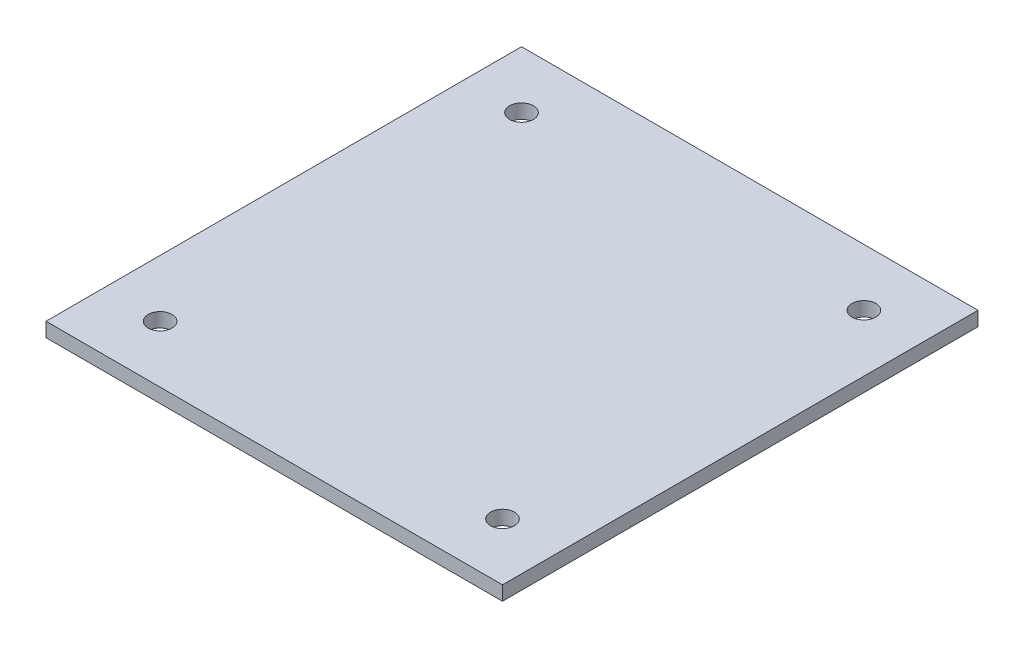
ISO-10303-21;
HEADER;
FILE_DESCRIPTION(('STEP AP214'),'2;1');
FILE_NAME('part.step','',(''),(''),'','','');
FILE_SCHEMA(('AUTOMOTIVE_DESIGN { 1 0 10303 214 1 1 1 1 }'));
ENDSEC;
DATA;
#1=APPLICATION_CONTEXT('core data for automotive mechanical design processes');
#2=APPLICATION_PROTOCOL_DEFINITION('international standard','automotive_design',2000,#1);
#3=PRODUCT_CONTEXT('',#1,'mechanical');
#4=PRODUCT('Part','Part','',(#3));
#5=PRODUCT_RELATED_PRODUCT_CATEGORY('part','',(#4));
#6=PRODUCT_DEFINITION_FORMATION('','',#4);
#7=PRODUCT_DEFINITION_CONTEXT('part definition',#1,'design');
#8=PRODUCT_DEFINITION('design','',#6,#7);
#9=PRODUCT_DEFINITION_SHAPE('','',#8);
#10=(LENGTH_UNIT() NAMED_UNIT(*) SI_UNIT(.MILLI.,.METRE.));
#11=(NAMED_UNIT(*) PLANE_ANGLE_UNIT() SI_UNIT($,.RADIAN.));
#12=(NAMED_UNIT(*) SI_UNIT($,.STERADIAN.) SOLID_ANGLE_UNIT());
#13=UNCERTAINTY_MEASURE_WITH_UNIT(LENGTH_MEASURE(1.E-05),#10,'distance_accuracy_value','');
#14=(GEOMETRIC_REPRESENTATION_CONTEXT(3) GLOBAL_UNCERTAINTY_ASSIGNED_CONTEXT((#13)) GLOBAL_UNIT_ASSIGNED_CONTEXT((#10,
#11,#12)) REPRESENTATION_CONTEXT('',''));
#15=CARTESIAN_POINT('',(0.,0.,0.));
#16=DIRECTION('',(0.,0.,1.));
#17=DIRECTION('',(1.,0.,0.));
#18=AXIS2_PLACEMENT_3D('',#15,#16,#17);
#19=CARTESIAN_POINT('',(-76.2,4.7625,-79.375));
#20=DIRECTION('',(1.,0.,0.));
#21=DIRECTION('',(0.,0.,-1.));
#22=AXIS2_PLACEMENT_3D('',#19,#20,#21);
#23=PLANE('',#22);
#24=DIRECTION('',(0.,0.,1.));
#25=VECTOR('',#24,1.);
#26=CARTESIAN_POINT('',(-76.2,0.,-79.375));
#27=LINE('',#26,#25);
#28=CARTESIAN_POINT('',(-76.2,0.,-79.375));
#29=VERTEX_POINT('',#28);
#30=CARTESIAN_POINT('',(-76.2,0.,79.375));
#31=VERTEX_POINT('',#30);
#32=EDGE_CURVE('E116',#29,#31,#27,.T.);
#33=ORIENTED_EDGE('',*,*,#32,.T.);
#34=DIRECTION('',(0.,-1.,0.));
#35=VECTOR('',#34,1.);
#36=CARTESIAN_POINT('',(-76.2,4.7625,79.375));
#37=LINE('',#36,#35);
#38=CARTESIAN_POINT('',(-76.2,4.7625,79.375));
#39=VERTEX_POINT('',#38);
#40=EDGE_CURVE('E11',#39,#31,#37,.T.);
#41=ORIENTED_EDGE('',*,*,#40,.F.);
#42=DIRECTION('',(0.,0.,1.));
#43=VECTOR('',#42,1.);
#44=CARTESIAN_POINT('',(-76.2,4.7625,-79.375));
#45=LINE('',#44,#43);
#46=CARTESIAN_POINT('',(-76.2,4.7625,-79.375));
#47=VERTEX_POINT('',#46);
#48=EDGE_CURVE('E99',#47,#39,#45,.T.);
#49=ORIENTED_EDGE('',*,*,#48,.F.);
#50=DIRECTION('',(0.,-1.,0.));
#51=VECTOR('',#50,1.);
#52=CARTESIAN_POINT('',(-76.2,4.7625,-79.375));
#53=LINE('',#52,#51);
#54=EDGE_CURVE('E112',#47,#29,#53,.T.);
#55=ORIENTED_EDGE('',*,*,#54,.T.);
#56=EDGE_LOOP('',(#33,#41,#49,#55));
#57=FACE_BOUND('',#56,.T.);
#58=ADVANCED_FACE('F39',(#57),#23,.F.);
#59=CARTESIAN_POINT('',(76.2,4.7625,79.375));
#60=DIRECTION('',(0.,0.,-1.));
#61=DIRECTION('',(-1.,0.,0.));
#62=AXIS2_PLACEMENT_3D('',#59,#60,#61);
#63=PLANE('',#62);
#64=DIRECTION('',(1.,0.,0.));
#65=VECTOR('',#64,1.);
#66=CARTESIAN_POINT('',(76.2,0.,79.375));
#67=LINE('',#66,#65);
#68=CARTESIAN_POINT('',(76.2,0.,79.375));
#69=VERTEX_POINT('',#68);
#70=EDGE_CURVE('E104',#31,#69,#67,.T.);
#71=ORIENTED_EDGE('',*,*,#70,.T.);
#72=DIRECTION('',(0.,-1.,0.));
#73=VECTOR('',#72,1.);
#74=CARTESIAN_POINT('',(76.2,4.7625,79.375));
#75=LINE('',#74,#73);
#76=CARTESIAN_POINT('',(76.2,4.7625,79.375));
#77=VERTEX_POINT('',#76);
#78=EDGE_CURVE('E48',#77,#69,#75,.T.);
#79=ORIENTED_EDGE('',*,*,#78,.F.);
#80=DIRECTION('',(1.,0.,0.));
#81=VECTOR('',#80,1.);
#82=CARTESIAN_POINT('',(76.2,4.7625,79.375));
#83=LINE('',#82,#81);
#84=EDGE_CURVE('E94',#39,#77,#83,.T.);
#85=ORIENTED_EDGE('',*,*,#84,.F.);
#86=ORIENTED_EDGE('',*,*,#40,.T.);
#87=EDGE_LOOP('',(#71,#79,#85,#86));
#88=FACE_BOUND('',#87,.T.);
#89=ADVANCED_FACE('F103',(#88),#63,.F.);
#90=CARTESIAN_POINT('',(76.2,4.7625,-79.375));
#91=DIRECTION('',(-1.,0.,0.));
#92=DIRECTION('',(0.,0.,1.));
#93=AXIS2_PLACEMENT_3D('',#90,#91,#92);
#94=PLANE('',#93);
#95=DIRECTION('',(0.,0.,-1.));
#96=VECTOR('',#95,1.);
#97=CARTESIAN_POINT('',(76.2,0.,-79.375));
#98=LINE('',#97,#96);
#99=CARTESIAN_POINT('',(76.2,0.,-79.375));
#100=VERTEX_POINT('',#99);
#101=EDGE_CURVE('E79',#69,#100,#98,.T.);
#102=ORIENTED_EDGE('',*,*,#101,.T.);
#103=DIRECTION('',(0.,-1.,0.));
#104=VECTOR('',#103,1.);
#105=CARTESIAN_POINT('',(76.2,4.7625,-79.375));
#106=LINE('',#105,#104);
#107=CARTESIAN_POINT('',(76.2,4.7625,-79.375));
#108=VERTEX_POINT('',#107);
#109=EDGE_CURVE('E106',#108,#100,#106,.T.);
#110=ORIENTED_EDGE('',*,*,#109,.F.);
#111=DIRECTION('',(0.,0.,-1.));
#112=VECTOR('',#111,1.);
#113=CARTESIAN_POINT('',(76.2,4.7625,-79.375));
#114=LINE('',#113,#112);
#115=EDGE_CURVE('E97',#77,#108,#114,.T.);
#116=ORIENTED_EDGE('',*,*,#115,.F.);
#117=ORIENTED_EDGE('',*,*,#78,.T.);
#118=EDGE_LOOP('',(#102,#110,#116,#117));
#119=FACE_BOUND('',#118,.T.);
#120=ADVANCED_FACE('F107',(#119),#94,.F.);
#121=CARTESIAN_POINT('',(76.2,4.7625,-79.375));
#122=DIRECTION('',(0.,0.,1.));
#123=DIRECTION('',(1.,0.,0.));
#124=AXIS2_PLACEMENT_3D('',#121,#122,#123);
#125=PLANE('',#124);
#126=DIRECTION('',(-1.,0.,0.));
#127=VECTOR('',#126,1.);
#128=CARTESIAN_POINT('',(76.2,0.,-79.375));
#129=LINE('',#128,#127);
#130=EDGE_CURVE('E87',#100,#29,#129,.T.);
#131=ORIENTED_EDGE('',*,*,#130,.T.);
#132=ORIENTED_EDGE('',*,*,#54,.F.);
#133=DIRECTION('',(-1.,0.,0.));
#134=VECTOR('',#133,1.);
#135=CARTESIAN_POINT('',(76.2,4.7625,-79.375));
#136=LINE('',#135,#134);
#137=EDGE_CURVE('E58',#108,#47,#136,.T.);
#138=ORIENTED_EDGE('',*,*,#137,.F.);
#139=ORIENTED_EDGE('',*,*,#109,.T.);
#140=EDGE_LOOP('',(#131,#132,#138,#139));
#141=FACE_BOUND('',#140,.T.);
#142=ADVANCED_FACE('F130',(#141),#125,.F.);
#143=CARTESIAN_POINT('',(-76.2,4.7625,79.375));
#144=DIRECTION('',(0.,-1.,0.));
#145=DIRECTION('',(0.,0.,-1.));
#146=AXIS2_PLACEMENT_3D('',#143,#144,#145);
#147=PLANE('',#146);
#148=CARTESIAN_POINT('',(57.15,4.7625,60.325));
#149=DIRECTION('',(0.,1.,0.));
#150=DIRECTION('',(0.,0.,1.));
#151=AXIS2_PLACEMENT_3D('',#148,#149,#150);
#152=CIRCLE('',#151,3.96874999999999);
#153=CARTESIAN_POINT('',(57.15,4.7625,64.29375));
#154=VERTEX_POINT('',#153);
#155=EDGE_CURVE('E161',#154,#154,#152,.T.);
#156=ORIENTED_EDGE('',*,*,#155,.F.);
#157=EDGE_LOOP('',(#156));
#158=FACE_BOUND('',#157,.T.);
#159=CARTESIAN_POINT('',(-57.15,4.7625,60.325));
#160=DIRECTION('',(0.,1.,0.));
#161=DIRECTION('',(0.,0.,1.));
#162=AXIS2_PLACEMENT_3D('',#159,#160,#161);
#163=CIRCLE('',#162,3.96874999999999);
#164=CARTESIAN_POINT('',(-57.15,4.7625,64.29375));
#165=VERTEX_POINT('',#164);
#166=EDGE_CURVE('E153',#165,#165,#163,.T.);
#167=ORIENTED_EDGE('',*,*,#166,.F.);
#168=EDGE_LOOP('',(#167));
#169=FACE_BOUND('',#168,.T.);
#170=CARTESIAN_POINT('',(57.15,4.7625,-60.325));
#171=DIRECTION('',(0.,1.,0.));
#172=DIRECTION('',(0.,0.,1.));
#173=AXIS2_PLACEMENT_3D('',#170,#171,#172);
#174=CIRCLE('',#173,3.96874999999999);
#175=CARTESIAN_POINT('',(57.15,4.7625,-56.35625));
#176=VERTEX_POINT('',#175);
#177=EDGE_CURVE('E145',#176,#176,#174,.T.);
#178=ORIENTED_EDGE('',*,*,#177,.F.);
#179=EDGE_LOOP('',(#178));
#180=FACE_BOUND('',#179,.T.);
#181=CARTESIAN_POINT('',(-57.15,4.7625,-60.325));
#182=DIRECTION('',(0.,1.,0.));
#183=DIRECTION('',(0.,0.,1.));
#184=AXIS2_PLACEMENT_3D('',#181,#182,#183);
#185=CIRCLE('',#184,3.96874999999999);
#186=CARTESIAN_POINT('',(-57.15,4.7625,-56.35625));
#187=VERTEX_POINT('',#186);
#188=EDGE_CURVE('E138',#187,#187,#185,.T.);
#189=ORIENTED_EDGE('',*,*,#188,.F.);
#190=EDGE_LOOP('',(#189));
#191=FACE_BOUND('',#190,.T.);
#192=ORIENTED_EDGE('',*,*,#48,.T.);
#193=ORIENTED_EDGE('',*,*,#84,.T.);
#194=ORIENTED_EDGE('',*,*,#115,.T.);
#195=ORIENTED_EDGE('',*,*,#137,.T.);
#196=EDGE_LOOP('',(#192,#193,#194,#195));
#197=FACE_BOUND('',#196,.T.);
#198=ADVANCED_FACE('F95',(#158,#169,#180,#191,#197),#147,.F.);
#199=CARTESIAN_POINT('',(-76.2,0.,79.375));
#200=DIRECTION('',(0.,-1.,0.));
#201=DIRECTION('',(0.,0.,-1.));
#202=AXIS2_PLACEMENT_3D('',#199,#200,#201);
#203=PLANE('',#202);
#204=CARTESIAN_POINT('',(57.15,0.,60.325));
#205=DIRECTION('',(0.,1.,0.));
#206=DIRECTION('',(0.,0.,1.));
#207=AXIS2_PLACEMENT_3D('',#204,#205,#206);
#208=CIRCLE('',#207,3.96874999999999);
#209=CARTESIAN_POINT('',(57.15,0.,64.29375));
#210=VERTEX_POINT('',#209);
#211=EDGE_CURVE('E157',#210,#210,#208,.T.);
#212=ORIENTED_EDGE('',*,*,#211,.T.);
#213=EDGE_LOOP('',(#212));
#214=FACE_BOUND('',#213,.T.);
#215=CARTESIAN_POINT('',(-57.15,0.,60.325));
#216=DIRECTION('',(0.,1.,0.));
#217=DIRECTION('',(0.,0.,1.));
#218=AXIS2_PLACEMENT_3D('',#215,#216,#217);
#219=CIRCLE('',#218,3.96874999999999);
#220=CARTESIAN_POINT('',(-57.15,0.,64.29375));
#221=VERTEX_POINT('',#220);
#222=EDGE_CURVE('E149',#221,#221,#219,.T.);
#223=ORIENTED_EDGE('',*,*,#222,.T.);
#224=EDGE_LOOP('',(#223));
#225=FACE_BOUND('',#224,.T.);
#226=CARTESIAN_POINT('',(57.15,0.,-60.325));
#227=DIRECTION('',(0.,1.,0.));
#228=DIRECTION('',(0.,0.,1.));
#229=AXIS2_PLACEMENT_3D('',#226,#227,#228);
#230=CIRCLE('',#229,3.96874999999999);
#231=CARTESIAN_POINT('',(57.15,0.,-56.35625));
#232=VERTEX_POINT('',#231);
#233=EDGE_CURVE('E141',#232,#232,#230,.T.);
#234=ORIENTED_EDGE('',*,*,#233,.T.);
#235=EDGE_LOOP('',(#234));
#236=FACE_BOUND('',#235,.T.);
#237=CARTESIAN_POINT('',(-57.15,0.,-60.325));
#238=DIRECTION('',(0.,1.,0.));
#239=DIRECTION('',(0.,0.,1.));
#240=AXIS2_PLACEMENT_3D('',#237,#238,#239);
#241=CIRCLE('',#240,3.96874999999999);
#242=CARTESIAN_POINT('',(-57.15,0.,-56.35625));
#243=VERTEX_POINT('',#242);
#244=EDGE_CURVE('E120',#243,#243,#241,.T.);
#245=ORIENTED_EDGE('',*,*,#244,.T.);
#246=EDGE_LOOP('',(#245));
#247=FACE_BOUND('',#246,.T.);
#248=ORIENTED_EDGE('',*,*,#32,.F.);
#249=ORIENTED_EDGE('',*,*,#130,.F.);
#250=ORIENTED_EDGE('',*,*,#101,.F.);
#251=ORIENTED_EDGE('',*,*,#70,.F.);
#252=EDGE_LOOP('',(#248,#249,#250,#251));
#253=FACE_BOUND('',#252,.T.);
#254=ADVANCED_FACE('F133',(#214,#225,#236,#247,#253),#203,.T.);
#255=CARTESIAN_POINT('',(-57.15,0.,-60.325));
#256=DIRECTION('',(0.,1.,0.));
#257=DIRECTION('',(0.,0.,1.));
#258=AXIS2_PLACEMENT_3D('',#255,#256,#257);
#259=CYLINDRICAL_SURFACE('',#258,3.96874999999999);
#260=ORIENTED_EDGE('',*,*,#244,.F.);
#261=EDGE_LOOP('',(#260));
#262=FACE_BOUND('',#261,.T.);
#263=ORIENTED_EDGE('',*,*,#188,.T.);
#264=EDGE_LOOP('',(#263));
#265=FACE_BOUND('',#264,.T.);
#266=ADVANCED_FACE('F186',(#262,#265),#259,.F.);
#267=CARTESIAN_POINT('',(57.15,0.,-60.325));
#268=DIRECTION('',(0.,1.,0.));
#269=DIRECTION('',(0.,0.,1.));
#270=AXIS2_PLACEMENT_3D('',#267,#268,#269);
#271=CYLINDRICAL_SURFACE('',#270,3.96874999999999);
#272=ORIENTED_EDGE('',*,*,#233,.F.);
#273=EDGE_LOOP('',(#272));
#274=FACE_BOUND('',#273,.T.);
#275=ORIENTED_EDGE('',*,*,#177,.T.);
#276=EDGE_LOOP('',(#275));
#277=FACE_BOUND('',#276,.T.);
#278=ADVANCED_FACE('F188',(#274,#277),#271,.F.);
#279=CARTESIAN_POINT('',(-57.15,0.,60.325));
#280=DIRECTION('',(0.,1.,0.));
#281=DIRECTION('',(0.,0.,1.));
#282=AXIS2_PLACEMENT_3D('',#279,#280,#281);
#283=CYLINDRICAL_SURFACE('',#282,3.96874999999999);
#284=ORIENTED_EDGE('',*,*,#222,.F.);
#285=EDGE_LOOP('',(#284));
#286=FACE_BOUND('',#285,.T.);
#287=ORIENTED_EDGE('',*,*,#166,.T.);
#288=EDGE_LOOP('',(#287));
#289=FACE_BOUND('',#288,.T.);
#290=ADVANCED_FACE('F173',(#286,#289),#283,.F.);
#291=CARTESIAN_POINT('',(57.15,0.,60.325));
#292=DIRECTION('',(0.,1.,0.));
#293=DIRECTION('',(0.,0.,1.));
#294=AXIS2_PLACEMENT_3D('',#291,#292,#293);
#295=CYLINDRICAL_SURFACE('',#294,3.96874999999999);
#296=ORIENTED_EDGE('',*,*,#211,.F.);
#297=EDGE_LOOP('',(#296));
#298=FACE_BOUND('',#297,.T.);
#299=ORIENTED_EDGE('',*,*,#155,.T.);
#300=EDGE_LOOP('',(#299));
#301=FACE_BOUND('',#300,.T.);
#302=ADVANCED_FACE('F170',(#298,#301),#295,.F.);
#303=CLOSED_SHELL('',(#58,#89,#120,#142,#198,#254,#266,#278,#290,#302));
#304=MANIFOLD_SOLID_BREP('B2',#303);
#305=ADVANCED_BREP_SHAPE_REPRESENTATION('',(#18,#304),#14);
#306=SHAPE_DEFINITION_REPRESENTATION(#9,#305);
ENDSEC;
END-ISO-10303-21;
